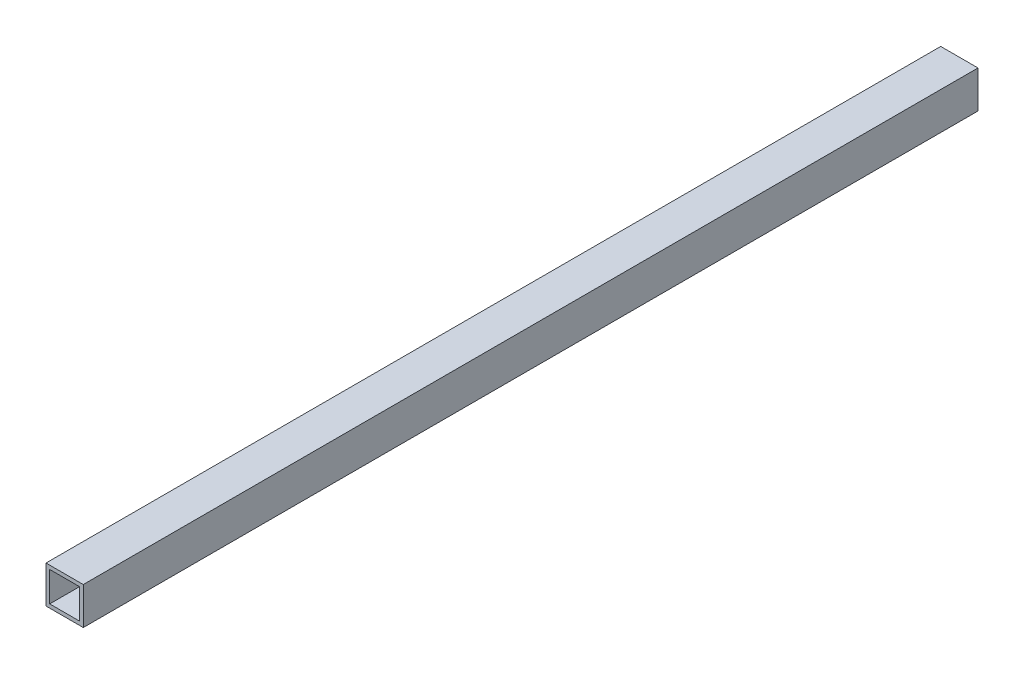
ISO-10303-21;
HEADER;
FILE_DESCRIPTION(('STEP AP214'),'2;1');
FILE_NAME('part.step','',(''),(''),'','','');
FILE_SCHEMA(('AUTOMOTIVE_DESIGN { 1 0 10303 214 1 1 1 1 }'));
ENDSEC;
DATA;
#1=APPLICATION_CONTEXT('core data for automotive mechanical design processes');
#2=APPLICATION_PROTOCOL_DEFINITION('international standard','automotive_design',2000,#1);
#3=PRODUCT_CONTEXT('',#1,'mechanical');
#4=PRODUCT('Part','Part','',(#3));
#5=PRODUCT_RELATED_PRODUCT_CATEGORY('part','',(#4));
#6=PRODUCT_DEFINITION_FORMATION('','',#4);
#7=PRODUCT_DEFINITION_CONTEXT('part definition',#1,'design');
#8=PRODUCT_DEFINITION('design','',#6,#7);
#9=PRODUCT_DEFINITION_SHAPE('','',#8);
#10=(LENGTH_UNIT() NAMED_UNIT(*) SI_UNIT(.MILLI.,.METRE.));
#11=(NAMED_UNIT(*) PLANE_ANGLE_UNIT() SI_UNIT($,.RADIAN.));
#12=(NAMED_UNIT(*) SI_UNIT($,.STERADIAN.) SOLID_ANGLE_UNIT());
#13=UNCERTAINTY_MEASURE_WITH_UNIT(LENGTH_MEASURE(1.E-05),#10,'distance_accuracy_value','');
#14=(GEOMETRIC_REPRESENTATION_CONTEXT(3) GLOBAL_UNCERTAINTY_ASSIGNED_CONTEXT((#13)) GLOBAL_UNIT_ASSIGNED_CONTEXT((#10,
#11,#12)) REPRESENTATION_CONTEXT('',''));
#15=CARTESIAN_POINT('',(0.,0.,0.));
#16=DIRECTION('',(0.,0.,1.));
#17=DIRECTION('',(1.,0.,0.));
#18=AXIS2_PLACEMENT_3D('',#15,#16,#17);
#19=CARTESIAN_POINT('',(-20.,20.,500.));
#20=DIRECTION('',(1.,0.,0.));
#21=DIRECTION('',(0.,0.,-1.));
#22=AXIS2_PLACEMENT_3D('',#19,#20,#21);
#23=PLANE('',#22);
#24=DIRECTION('',(0.,0.,-1.));
#25=VECTOR('',#24,1.);
#26=CARTESIAN_POINT('',(-20.,-20.,500.));
#27=LINE('',#26,#25);
#28=CARTESIAN_POINT('',(-20.,-20.,500.));
#29=VERTEX_POINT('',#28);
#30=CARTESIAN_POINT('',(-20.,-20.,-460.));
#31=VERTEX_POINT('',#30);
#32=EDGE_CURVE('E99',#29,#31,#27,.T.);
#33=ORIENTED_EDGE('',*,*,#32,.F.);
#34=DIRECTION('',(0.,-1.,0.));
#35=VECTOR('',#34,1.);
#36=CARTESIAN_POINT('',(-20.,20.,500.));
#37=LINE('',#36,#35);
#38=CARTESIAN_POINT('',(-20.,20.,500.));
#39=VERTEX_POINT('',#38);
#40=EDGE_CURVE('E88',#39,#29,#37,.T.);
#41=ORIENTED_EDGE('',*,*,#40,.F.);
#42=DIRECTION('',(0.,0.,-1.));
#43=VECTOR('',#42,1.);
#44=CARTESIAN_POINT('',(-20.,20.,500.));
#45=LINE('',#44,#43);
#46=CARTESIAN_POINT('',(-20.,20.,-460.));
#47=VERTEX_POINT('',#46);
#48=EDGE_CURVE('E104',#39,#47,#45,.T.);
#49=ORIENTED_EDGE('',*,*,#48,.T.);
#50=DIRECTION('',(0.,-1.,0.));
#51=VECTOR('',#50,1.);
#52=CARTESIAN_POINT('',(-20.,20.,-460.));
#53=LINE('',#52,#51);
#54=EDGE_CURVE('E100',#47,#31,#53,.T.);
#55=ORIENTED_EDGE('',*,*,#54,.T.);
#56=EDGE_LOOP('',(#33,#41,#49,#55));
#57=FACE_BOUND('',#56,.T.);
#58=ADVANCED_FACE('F36',(#57),#23,.F.);
#59=CARTESIAN_POINT('',(-20.,-20.,500.));
#60=DIRECTION('',(0.,1.,0.));
#61=DIRECTION('',(0.,0.,1.));
#62=AXIS2_PLACEMENT_3D('',#59,#60,#61);
#63=PLANE('',#62);
#64=DIRECTION('',(0.,0.,-1.));
#65=VECTOR('',#64,1.);
#66=CARTESIAN_POINT('',(20.,-20.,500.));
#67=LINE('',#66,#65);
#68=CARTESIAN_POINT('',(20.,-20.,500.));
#69=VERTEX_POINT('',#68);
#70=CARTESIAN_POINT('',(20.,-20.,-460.));
#71=VERTEX_POINT('',#70);
#72=EDGE_CURVE('E103',#69,#71,#67,.T.);
#73=ORIENTED_EDGE('',*,*,#72,.F.);
#74=DIRECTION('',(1.,0.,0.));
#75=VECTOR('',#74,1.);
#76=CARTESIAN_POINT('',(-20.,-20.,500.));
#77=LINE('',#76,#75);
#78=EDGE_CURVE('E85',#29,#69,#77,.T.);
#79=ORIENTED_EDGE('',*,*,#78,.F.);
#80=ORIENTED_EDGE('',*,*,#32,.T.);
#81=DIRECTION('',(1.,0.,0.));
#82=VECTOR('',#81,1.);
#83=CARTESIAN_POINT('',(-20.,-20.,-460.));
#84=LINE('',#83,#82);
#85=EDGE_CURVE('E126',#31,#71,#84,.T.);
#86=ORIENTED_EDGE('',*,*,#85,.T.);
#87=EDGE_LOOP('',(#73,#79,#80,#86));
#88=FACE_BOUND('',#87,.T.);
#89=ADVANCED_FACE('F106',(#88),#63,.F.);
#90=CARTESIAN_POINT('',(20.,20.,500.));
#91=DIRECTION('',(-1.,0.,0.));
#92=DIRECTION('',(0.,0.,1.));
#93=AXIS2_PLACEMENT_3D('',#90,#91,#92);
#94=PLANE('',#93);
#95=DIRECTION('',(0.,0.,-1.));
#96=VECTOR('',#95,1.);
#97=CARTESIAN_POINT('',(20.,20.,500.));
#98=LINE('',#97,#96);
#99=CARTESIAN_POINT('',(20.,20.,500.));
#100=VERTEX_POINT('',#99);
#101=CARTESIAN_POINT('',(20.,20.,-460.));
#102=VERTEX_POINT('',#101);
#103=EDGE_CURVE('E40',#100,#102,#98,.T.);
#104=ORIENTED_EDGE('',*,*,#103,.F.);
#105=DIRECTION('',(0.,1.,0.));
#106=VECTOR('',#105,1.);
#107=CARTESIAN_POINT('',(20.,20.,500.));
#108=LINE('',#107,#106);
#109=EDGE_CURVE('E109',#69,#100,#108,.T.);
#110=ORIENTED_EDGE('',*,*,#109,.F.);
#111=ORIENTED_EDGE('',*,*,#72,.T.);
#112=DIRECTION('',(0.,1.,0.));
#113=VECTOR('',#112,1.);
#114=CARTESIAN_POINT('',(20.,20.,-460.));
#115=LINE('',#114,#113);
#116=EDGE_CURVE('E113',#71,#102,#115,.T.);
#117=ORIENTED_EDGE('',*,*,#116,.T.);
#118=EDGE_LOOP('',(#104,#110,#111,#117));
#119=FACE_BOUND('',#118,.T.);
#120=ADVANCED_FACE('F124',(#119),#94,.F.);
#121=CARTESIAN_POINT('',(-20.,20.,500.));
#122=DIRECTION('',(0.,-1.,0.));
#123=DIRECTION('',(0.,0.,-1.));
#124=AXIS2_PLACEMENT_3D('',#121,#122,#123);
#125=PLANE('',#124);
#126=DIRECTION('',(-1.,0.,0.));
#127=VECTOR('',#126,1.);
#128=CARTESIAN_POINT('',(-20.,20.,-460.));
#129=LINE('',#128,#127);
#130=EDGE_CURVE('E123',#102,#47,#129,.T.);
#131=ORIENTED_EDGE('',*,*,#130,.T.);
#132=ORIENTED_EDGE('',*,*,#48,.F.);
#133=DIRECTION('',(-1.,0.,0.));
#134=VECTOR('',#133,1.);
#135=CARTESIAN_POINT('',(-20.,20.,500.));
#136=LINE('',#135,#134);
#137=EDGE_CURVE('E92',#100,#39,#136,.T.);
#138=ORIENTED_EDGE('',*,*,#137,.F.);
#139=ORIENTED_EDGE('',*,*,#103,.T.);
#140=EDGE_LOOP('',(#131,#132,#138,#139));
#141=FACE_BOUND('',#140,.T.);
#142=ADVANCED_FACE('F38',(#141),#125,.F.);
#143=CARTESIAN_POINT('',(0.,0.,500.));
#144=DIRECTION('',(0.,0.,1.));
#145=DIRECTION('',(1.,0.,0.));
#146=AXIS2_PLACEMENT_3D('',#143,#144,#145);
#147=PLANE('',#146);
#148=DIRECTION('',(0.,-1.,0.));
#149=VECTOR('',#148,1.);
#150=CARTESIAN_POINT('',(-16.,16.,500.));
#151=LINE('',#150,#149);
#152=CARTESIAN_POINT('',(-16.,-16.,500.));
#153=VERTEX_POINT('',#152);
#154=CARTESIAN_POINT('',(-16.,16.,500.));
#155=VERTEX_POINT('',#154);
#156=EDGE_CURVE('E131',#153,#155,#151,.F.);
#157=ORIENTED_EDGE('',*,*,#156,.T.);
#158=DIRECTION('',(-1.,0.,0.));
#159=VECTOR('',#158,1.);
#160=CARTESIAN_POINT('',(-16.,16.,500.));
#161=LINE('',#160,#159);
#162=CARTESIAN_POINT('',(16.,16.,500.));
#163=VERTEX_POINT('',#162);
#164=EDGE_CURVE('E127',#155,#163,#161,.F.);
#165=ORIENTED_EDGE('',*,*,#164,.T.);
#166=DIRECTION('',(0.,1.,0.));
#167=VECTOR('',#166,1.);
#168=CARTESIAN_POINT('',(16.,16.,500.));
#169=LINE('',#168,#167);
#170=CARTESIAN_POINT('',(16.,-16.,500.));
#171=VERTEX_POINT('',#170);
#172=EDGE_CURVE('E145',#163,#171,#169,.F.);
#173=ORIENTED_EDGE('',*,*,#172,.T.);
#174=DIRECTION('',(1.,0.,0.));
#175=VECTOR('',#174,1.);
#176=CARTESIAN_POINT('',(-16.,-16.,500.));
#177=LINE('',#176,#175);
#178=EDGE_CURVE('E135',#171,#153,#177,.F.);
#179=ORIENTED_EDGE('',*,*,#178,.T.);
#180=EDGE_LOOP('',(#157,#165,#173,#179));
#181=FACE_BOUND('',#180,.T.);
#182=ORIENTED_EDGE('',*,*,#40,.T.);
#183=ORIENTED_EDGE('',*,*,#78,.T.);
#184=ORIENTED_EDGE('',*,*,#109,.T.);
#185=ORIENTED_EDGE('',*,*,#137,.T.);
#186=EDGE_LOOP('',(#182,#183,#184,#185));
#187=FACE_BOUND('',#186,.T.);
#188=ADVANCED_FACE('F90',(#181,#187),#147,.T.);
#189=CARTESIAN_POINT('',(0.,0.,-460.));
#190=DIRECTION('',(0.,0.,1.));
#191=DIRECTION('',(1.,0.,0.));
#192=AXIS2_PLACEMENT_3D('',#189,#190,#191);
#193=PLANE('',#192);
#194=DIRECTION('',(0.,-1.,0.));
#195=VECTOR('',#194,1.);
#196=CARTESIAN_POINT('',(-16.,16.,-460.));
#197=LINE('',#196,#195);
#198=CARTESIAN_POINT('',(-16.,-16.,-460.));
#199=VERTEX_POINT('',#198);
#200=CARTESIAN_POINT('',(-16.,16.,-460.));
#201=VERTEX_POINT('',#200);
#202=EDGE_CURVE('E11',#199,#201,#197,.F.);
#203=ORIENTED_EDGE('',*,*,#202,.F.);
#204=DIRECTION('',(1.,0.,0.));
#205=VECTOR('',#204,1.);
#206=CARTESIAN_POINT('',(-16.,-16.,-460.));
#207=LINE('',#206,#205);
#208=CARTESIAN_POINT('',(16.,-16.,-460.));
#209=VERTEX_POINT('',#208);
#210=EDGE_CURVE('E46',#209,#199,#207,.F.);
#211=ORIENTED_EDGE('',*,*,#210,.F.);
#212=DIRECTION('',(0.,1.,0.));
#213=VECTOR('',#212,1.);
#214=CARTESIAN_POINT('',(16.,16.,-460.));
#215=LINE('',#214,#213);
#216=CARTESIAN_POINT('',(16.,16.,-460.));
#217=VERTEX_POINT('',#216);
#218=EDGE_CURVE('E142',#217,#209,#215,.F.);
#219=ORIENTED_EDGE('',*,*,#218,.F.);
#220=DIRECTION('',(-1.,0.,0.));
#221=VECTOR('',#220,1.);
#222=CARTESIAN_POINT('',(-16.,16.,-460.));
#223=LINE('',#222,#221);
#224=EDGE_CURVE('E139',#201,#217,#223,.F.);
#225=ORIENTED_EDGE('',*,*,#224,.F.);
#226=EDGE_LOOP('',(#203,#211,#219,#225));
#227=FACE_BOUND('',#226,.T.);
#228=ORIENTED_EDGE('',*,*,#54,.F.);
#229=ORIENTED_EDGE('',*,*,#130,.F.);
#230=ORIENTED_EDGE('',*,*,#116,.F.);
#231=ORIENTED_EDGE('',*,*,#85,.F.);
#232=EDGE_LOOP('',(#228,#229,#230,#231));
#233=FACE_BOUND('',#232,.T.);
#234=ADVANCED_FACE('F192',(#227,#233),#193,.F.);
#235=CARTESIAN_POINT('',(-16.,16.,500.));
#236=DIRECTION('',(0.,1.,0.));
#237=DIRECTION('',(0.,0.,1.));
#238=AXIS2_PLACEMENT_3D('',#235,#236,#237);
#239=PLANE('',#238);
#240=DIRECTION('',(0.,0.,-1.));
#241=VECTOR('',#240,1.);
#242=CARTESIAN_POINT('',(16.,16.,500.));
#243=LINE('',#242,#241);
#244=EDGE_CURVE('E147',#163,#217,#243,.T.);
#245=ORIENTED_EDGE('',*,*,#244,.F.);
#246=ORIENTED_EDGE('',*,*,#164,.F.);
#247=DIRECTION('',(0.,0.,-1.));
#248=VECTOR('',#247,1.);
#249=CARTESIAN_POINT('',(-16.,16.,500.));
#250=LINE('',#249,#248);
#251=EDGE_CURVE('E134',#155,#201,#250,.T.);
#252=ORIENTED_EDGE('',*,*,#251,.T.);
#253=ORIENTED_EDGE('',*,*,#224,.T.);
#254=EDGE_LOOP('',(#245,#246,#252,#253));
#255=FACE_BOUND('',#254,.T.);
#256=ADVANCED_FACE('F169',(#255),#239,.F.);
#257=CARTESIAN_POINT('',(16.,16.,500.));
#258=DIRECTION('',(1.,0.,0.));
#259=DIRECTION('',(0.,0.,-1.));
#260=AXIS2_PLACEMENT_3D('',#257,#258,#259);
#261=PLANE('',#260);
#262=DIRECTION('',(0.,0.,-1.));
#263=VECTOR('',#262,1.);
#264=CARTESIAN_POINT('',(16.,-16.,500.));
#265=LINE('',#264,#263);
#266=EDGE_CURVE('E140',#171,#209,#265,.T.);
#267=ORIENTED_EDGE('',*,*,#266,.F.);
#268=ORIENTED_EDGE('',*,*,#172,.F.);
#269=ORIENTED_EDGE('',*,*,#244,.T.);
#270=ORIENTED_EDGE('',*,*,#218,.T.);
#271=EDGE_LOOP('',(#267,#268,#269,#270));
#272=FACE_BOUND('',#271,.T.);
#273=ADVANCED_FACE('F173',(#272),#261,.F.);
#274=CARTESIAN_POINT('',(-16.,-16.,500.));
#275=DIRECTION('',(0.,-1.,0.));
#276=DIRECTION('',(0.,0.,-1.));
#277=AXIS2_PLACEMENT_3D('',#274,#275,#276);
#278=PLANE('',#277);
#279=DIRECTION('',(0.,0.,-1.));
#280=VECTOR('',#279,1.);
#281=CARTESIAN_POINT('',(-16.,-16.,500.));
#282=LINE('',#281,#280);
#283=EDGE_CURVE('E136',#153,#199,#282,.T.);
#284=ORIENTED_EDGE('',*,*,#283,.F.);
#285=ORIENTED_EDGE('',*,*,#178,.F.);
#286=ORIENTED_EDGE('',*,*,#266,.T.);
#287=ORIENTED_EDGE('',*,*,#210,.T.);
#288=EDGE_LOOP('',(#284,#285,#286,#287));
#289=FACE_BOUND('',#288,.T.);
#290=ADVANCED_FACE('F181',(#289),#278,.F.);
#291=CARTESIAN_POINT('',(-16.,16.,500.));
#292=DIRECTION('',(-1.,0.,0.));
#293=DIRECTION('',(0.,0.,1.));
#294=AXIS2_PLACEMENT_3D('',#291,#292,#293);
#295=PLANE('',#294);
#296=ORIENTED_EDGE('',*,*,#202,.T.);
#297=ORIENTED_EDGE('',*,*,#251,.F.);
#298=ORIENTED_EDGE('',*,*,#156,.F.);
#299=ORIENTED_EDGE('',*,*,#283,.T.);
#300=EDGE_LOOP('',(#296,#297,#298,#299));
#301=FACE_BOUND('',#300,.T.);
#302=ADVANCED_FACE('F180',(#301),#295,.F.);
#303=CLOSED_SHELL('',(#58,#89,#120,#142,#188,#234,#256,#273,#290,#302));
#304=MANIFOLD_SOLID_BREP('B2',#303);
#305=ADVANCED_BREP_SHAPE_REPRESENTATION('',(#18,#304),#14);
#306=SHAPE_DEFINITION_REPRESENTATION(#9,#305);
ENDSEC;
END-ISO-10303-21;
